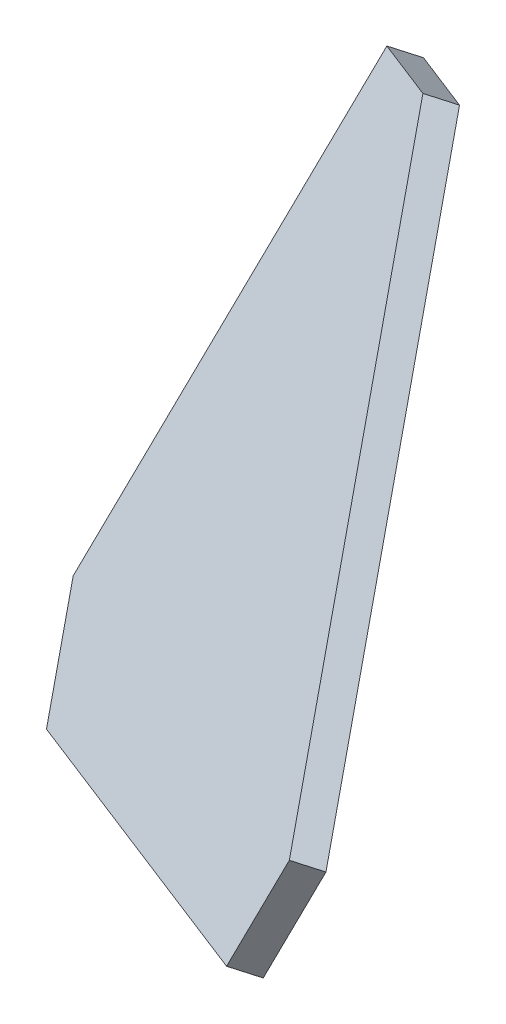
ISO-10303-21;
HEADER;
FILE_DESCRIPTION(('STEP AP214'),'2;1');
FILE_NAME('part.step','',(''),(''),'','','');
FILE_SCHEMA(('AUTOMOTIVE_DESIGN { 1 0 10303 214 1 1 1 1 }'));
ENDSEC;
DATA;
#1=APPLICATION_CONTEXT('core data for automotive mechanical design processes');
#2=APPLICATION_PROTOCOL_DEFINITION('international standard','automotive_design',2000,#1);
#3=PRODUCT_CONTEXT('',#1,'mechanical');
#4=PRODUCT('Part','Part','',(#3));
#5=PRODUCT_RELATED_PRODUCT_CATEGORY('part','',(#4));
#6=PRODUCT_DEFINITION_FORMATION('','',#4);
#7=PRODUCT_DEFINITION_CONTEXT('part definition',#1,'design');
#8=PRODUCT_DEFINITION('design','',#6,#7);
#9=PRODUCT_DEFINITION_SHAPE('','',#8);
#10=(LENGTH_UNIT() NAMED_UNIT(*) SI_UNIT(.MILLI.,.METRE.));
#11=(NAMED_UNIT(*) PLANE_ANGLE_UNIT() SI_UNIT($,.RADIAN.));
#12=(NAMED_UNIT(*) SI_UNIT($,.STERADIAN.) SOLID_ANGLE_UNIT());
#13=UNCERTAINTY_MEASURE_WITH_UNIT(LENGTH_MEASURE(1.E-05),#10,'distance_accuracy_value','');
#14=(GEOMETRIC_REPRESENTATION_CONTEXT(3) GLOBAL_UNCERTAINTY_ASSIGNED_CONTEXT((#13)) GLOBAL_UNIT_ASSIGNED_CONTEXT((#10,
#11,#12)) REPRESENTATION_CONTEXT('',''));
#15=CARTESIAN_POINT('',(0.,0.,0.));
#16=DIRECTION('',(0.,0.,1.));
#17=DIRECTION('',(1.,0.,0.));
#18=AXIS2_PLACEMENT_3D('',#15,#16,#17);
#19=CARTESIAN_POINT('',(1882.18704810196,3462.94317456264,123.456412175588));
#20=DIRECTION('',(-0.682550596637253,0.347776899554287,0.642787609686541));
#21=DIRECTION('',(0.685583574830509,0.,0.727993929866602));
#22=AXIS2_PLACEMENT_3D('',#19,#20,#21);
#23=PLANE('',#22);
#24=DIRECTION('',(0.453990499739547,0.891006524188367,0.));
#25=VECTOR('',#24,1.);
#26=CARTESIAN_POINT('',(1847.82337086807,3480.45234265152,77.4937455884498));
#27=LINE('',#26,#25);
#28=CARTESIAN_POINT('',(1847.82337086807,3480.45234265152,77.4937455884498));
#29=VERTEX_POINT('',#28);
#30=CARTESIAN_POINT('',(1870.52289585505,3525.00266886094,77.4937455884498));
#31=VERTEX_POINT('',#30);
#32=EDGE_CURVE('E113',#29,#31,#27,.T.);
#33=ORIENTED_EDGE('',*,*,#32,.T.);
#34=DIRECTION('',(-0.725999580936584,-0.423689230525368,-0.541675220419696));
#35=VECTOR('',#34,1.);
#36=CARTESIAN_POINT('',(1870.52289585505,3525.00266886094,77.4937455884498));
#37=LINE('',#36,#35);
#38=CARTESIAN_POINT('',(1880.79008039142,3530.99453942134,85.1541900196396));
#39=VERTEX_POINT('',#38);
#40=EDGE_CURVE('E63',#31,#39,#37,.F.);
#41=ORIENTED_EDGE('',*,*,#40,.T.);
#42=DIRECTION('',(0.572727953898155,-0.29181946814798,0.766044443118976));
#43=VECTOR('',#42,1.);
#44=CARTESIAN_POINT('',(1909.42647808633,3516.40356601394,123.456412175588));
#45=LINE('',#44,#43);
#46=CARTESIAN_POINT('',(1909.42647808633,3516.40356601394,123.456412175588));
#47=VERTEX_POINT('',#46);
#48=EDGE_CURVE('E121',#39,#47,#45,.T.);
#49=ORIENTED_EDGE('',*,*,#48,.T.);
#50=DIRECTION('',(0.453990499739547,0.891006524188367,0.));
#51=VECTOR('',#50,1.);
#52=CARTESIAN_POINT('',(1882.18704810196,3462.94317456264,123.456412175588));
#53=LINE('',#52,#51);
#54=CARTESIAN_POINT('',(1904.88657308893,3507.49350077206,123.456412175588));
#55=VERTEX_POINT('',#54);
#56=EDGE_CURVE('E129',#55,#47,#53,.T.);
#57=ORIENTED_EDGE('',*,*,#56,.F.);
#58=DIRECTION('',(-0.725999580936585,-0.423689230525358,-0.541675220419702));
#59=VECTOR('',#58,1.);
#60=CARTESIAN_POINT('',(1853.55065040705,3477.53414797004,85.15419001964));
#61=LINE('',#60,#59);
#62=CARTESIAN_POINT('',(1853.55065040705,3477.53414797004,85.1541900196393));
#63=VERTEX_POINT('',#62);
#64=EDGE_CURVE('E137',#55,#63,#61,.T.);
#65=ORIENTED_EDGE('',*,*,#64,.T.);
#66=DIRECTION('',(0.572727953898155,-0.29181946814798,0.766044443118976));
#67=VECTOR('',#66,1.);
#68=CARTESIAN_POINT('',(1882.18704810196,3462.94317456264,123.456412175588));
#69=LINE('',#68,#67);
#70=EDGE_CURVE('E103',#29,#63,#69,.T.);
#71=ORIENTED_EDGE('',*,*,#70,.F.);
#72=EDGE_LOOP('',(#33,#41,#49,#57,#65,#71));
#73=FACE_BOUND('',#72,.T.);
#74=ADVANCED_FACE('F41',(#73),#23,.F.);
#75=CARTESIAN_POINT('',(1882.18704810196,3462.94317456264,123.456412175588));
#76=DIRECTION('',(-0.572727953898148,0.291819468147979,-0.766044443118982));
#77=DIRECTION('',(-0.800905105421492,0.,0.598791292613536));
#78=AXIS2_PLACEMENT_3D('',#75,#76,#77);
#79=PLANE('',#78);
#80=DIRECTION('',(0.453990499739547,0.891006524188367,0.));
#81=VECTOR('',#80,1.);
#82=CARTESIAN_POINT('',(1880.82194690868,3463.63872836175,124.741987394962));
#83=LINE('',#82,#81);
#84=CARTESIAN_POINT('',(1903.52147189566,3508.18905457117,124.741987394962));
#85=VERTEX_POINT('',#84);
#86=CARTESIAN_POINT('',(1908.06137689306,3517.09911981305,124.741987394962));
#87=VERTEX_POINT('',#86);
#88=EDGE_CURVE('E112',#85,#87,#83,.T.);
#89=ORIENTED_EDGE('',*,*,#88,.F.);
#90=DIRECTION('',(0.682550596637234,-0.347776899554337,-0.642787609686534));
#91=VECTOR('',#90,1.);
#92=CARTESIAN_POINT('',(1904.88657308894,3507.49350077206,123.456412175587));
#93=LINE('',#92,#91);
#94=EDGE_CURVE('E135',#85,#55,#93,.T.);
#95=ORIENTED_EDGE('',*,*,#94,.T.);
#96=ORIENTED_EDGE('',*,*,#56,.T.);
#97=DIRECTION('',(-0.682550596637234,0.347776899554337,0.642787609686534));
#98=VECTOR('',#97,1.);
#99=CARTESIAN_POINT('',(1909.42647808633,3516.40356601394,123.456412175588));
#100=LINE('',#99,#98);
#101=EDGE_CURVE('E123',#47,#87,#100,.T.);
#102=ORIENTED_EDGE('',*,*,#101,.T.);
#103=EDGE_LOOP('',(#89,#95,#96,#102));
#104=FACE_BOUND('',#103,.T.);
#105=ADVANCED_FACE('F149',(#104),#79,.F.);
#106=CARTESIAN_POINT('',(1880.82194690868,3463.63872836175,124.741987394962));
#107=DIRECTION('',(0.682550596637253,-0.347776899554287,-0.642787609686541));
#108=DIRECTION('',(-0.685583574830509,0.,-0.727993929866602));
#109=AXIS2_PLACEMENT_3D('',#106,#107,#108);
#110=PLANE('',#109);
#111=DIRECTION('',(-0.572727953898155,0.29181946814798,-0.766044443118977));
#112=VECTOR('',#111,1.);
#113=CARTESIAN_POINT('',(1908.06137689306,3517.09911981305,124.741987394962));
#114=LINE('',#113,#112);
#115=CARTESIAN_POINT('',(1879.42497919815,3531.69009322045,86.4397652390121));
#116=VERTEX_POINT('',#115);
#117=EDGE_CURVE('E126',#87,#116,#114,.T.);
#118=ORIENTED_EDGE('',*,*,#117,.T.);
#119=DIRECTION('',(0.725999580936584,0.423689230525368,0.541675220419696));
#120=VECTOR('',#119,1.);
#121=CARTESIAN_POINT('',(1869.15779466177,3525.69822266005,78.7793208078229));
#122=LINE('',#121,#120);
#123=CARTESIAN_POINT('',(1869.15779466177,3525.69822266005,78.7793208078229));
#124=VERTEX_POINT('',#123);
#125=EDGE_CURVE('E11',#116,#124,#122,.F.);
#126=ORIENTED_EDGE('',*,*,#125,.T.);
#127=DIRECTION('',(0.453990499739547,0.891006524188367,0.));
#128=VECTOR('',#127,1.);
#129=CARTESIAN_POINT('',(1846.45826967479,3481.14789645063,78.7793208078229));
#130=LINE('',#129,#128);
#131=CARTESIAN_POINT('',(1846.45826967479,3481.14789645063,78.7793208078229));
#132=VERTEX_POINT('',#131);
#133=EDGE_CURVE('E106',#132,#124,#130,.T.);
#134=ORIENTED_EDGE('',*,*,#133,.F.);
#135=DIRECTION('',(-0.572727953898155,0.29181946814798,-0.766044443118977));
#136=VECTOR('',#135,1.);
#137=CARTESIAN_POINT('',(1880.82194690868,3463.63872836175,124.741987394962));
#138=LINE('',#137,#136);
#139=CARTESIAN_POINT('',(1852.18554921377,3478.22970176915,86.4397652390124));
#140=VERTEX_POINT('',#139);
#141=EDGE_CURVE('E93',#140,#132,#138,.T.);
#142=ORIENTED_EDGE('',*,*,#141,.F.);
#143=DIRECTION('',(0.725999580936585,0.423689230525358,0.541675220419703));
#144=VECTOR('',#143,1.);
#145=CARTESIAN_POINT('',(1852.18554921378,3478.22970176915,86.439765239013));
#146=LINE('',#145,#144);
#147=EDGE_CURVE('E133',#140,#85,#146,.T.);
#148=ORIENTED_EDGE('',*,*,#147,.T.);
#149=ORIENTED_EDGE('',*,*,#88,.T.);
#150=EDGE_LOOP('',(#118,#126,#134,#142,#148,#149));
#151=FACE_BOUND('',#150,.T.);
#152=ADVANCED_FACE('F107',(#151),#110,.F.);
#153=CARTESIAN_POINT('',(1846.45826967479,3481.14789645063,78.7793208078229));
#154=DIRECTION('',(0.572727953898141,-0.291819468147975,0.766044443118989));
#155=DIRECTION('',(0.800905105421498,0.,-0.598791292613527));
#156=AXIS2_PLACEMENT_3D('',#153,#154,#155);
#157=PLANE('',#156);
#158=ORIENTED_EDGE('',*,*,#133,.T.);
#159=DIRECTION('',(0.68255059663724,-0.34777689955434,-0.642787609686526));
#160=VECTOR('',#159,1.);
#161=CARTESIAN_POINT('',(1869.15779466177,3525.69822266005,78.7793208078212));
#162=LINE('',#161,#160);
#163=EDGE_CURVE('E139',#124,#31,#162,.T.);
#164=ORIENTED_EDGE('',*,*,#163,.T.);
#165=ORIENTED_EDGE('',*,*,#32,.F.);
#166=DIRECTION('',(0.68255059663724,-0.34777689955434,-0.642787609686526));
#167=VECTOR('',#166,1.);
#168=CARTESIAN_POINT('',(1846.45826967479,3481.14789645063,78.7793208078229));
#169=LINE('',#168,#167);
#170=EDGE_CURVE('E98',#132,#29,#169,.T.);
#171=ORIENTED_EDGE('',*,*,#170,.F.);
#172=EDGE_LOOP('',(#158,#164,#165,#171));
#173=FACE_BOUND('',#172,.T.);
#174=ADVANCED_FACE('F115',(#173),#157,.F.);
#175=CARTESIAN_POINT('',(1788.72256897396,3510.5657053021,-1.42219087416938E-10));
#176=DIRECTION('',(-0.453990499739582,-0.89100652418835,0.));
#177=DIRECTION('',(0.89100652418835,-0.453990499739582,0.));
#178=AXIS2_PLACEMENT_3D('',#175,#176,#177);
#179=PLANE('',#178);
#180=ORIENTED_EDGE('',*,*,#70,.T.);
#181=DIRECTION('',(-0.682550596637234,0.347776899554337,0.642787609686534));
#182=VECTOR('',#181,1.);
#183=CARTESIAN_POINT('',(1852.18554921378,3478.22970176915,86.4397652390128));
#184=LINE('',#183,#182);
#185=EDGE_CURVE('E101',#63,#140,#184,.T.);
#186=ORIENTED_EDGE('',*,*,#185,.T.);
#187=ORIENTED_EDGE('',*,*,#141,.T.);
#188=ORIENTED_EDGE('',*,*,#170,.T.);
#189=EDGE_LOOP('',(#180,#186,#187,#188));
#190=FACE_BOUND('',#189,.T.);
#191=ADVANCED_FACE('F96',(#190),#179,.T.);
#192=CARTESIAN_POINT('',(1815.96199895833,3564.0260967534,-1.42219569454483E-10));
#193=DIRECTION('',(-0.453990499739582,-0.89100652418835,0.));
#194=DIRECTION('',(0.89100652418835,-0.453990499739582,0.));
#195=AXIS2_PLACEMENT_3D('',#192,#193,#194);
#196=PLANE('',#195);
#197=ORIENTED_EDGE('',*,*,#48,.F.);
#198=DIRECTION('',(-0.68255059663724,0.34777689955434,0.642787609686526));
#199=VECTOR('',#198,1.);
#200=CARTESIAN_POINT('',(1880.10752979493,3531.34231632083,85.7969776291921));
#201=LINE('',#200,#199);
#202=EDGE_CURVE('E49',#39,#116,#201,.T.);
#203=ORIENTED_EDGE('',*,*,#202,.T.);
#204=ORIENTED_EDGE('',*,*,#117,.F.);
#205=ORIENTED_EDGE('',*,*,#101,.F.);
#206=EDGE_LOOP('',(#197,#203,#204,#205));
#207=FACE_BOUND('',#206,.T.);
#208=ADVANCED_FACE('F151',(#207),#196,.F.);
#209=CARTESIAN_POINT('',(1852.86809981056,3477.88192486952,85.7969776291918));
#210=DIRECTION('',(0.0839600590163456,-0.836384280144726,0.541675220419727));
#211=DIRECTION('',(0.682550596637234,-0.347776899554337,-0.642787609686534));
#212=AXIS2_PLACEMENT_3D('',#209,#210,#211);
#213=PLANE('',#212);
#214=ORIENTED_EDGE('',*,*,#64,.F.);
#215=ORIENTED_EDGE('',*,*,#94,.F.);
#216=ORIENTED_EDGE('',*,*,#147,.F.);
#217=ORIENTED_EDGE('',*,*,#185,.F.);
#218=EDGE_LOOP('',(#214,#215,#216,#217));
#219=FACE_BOUND('',#218,.T.);
#220=ADVANCED_FACE('F145',(#219),#213,.T.);
#221=CARTESIAN_POINT('',(1869.15779466177,3525.69822266005,78.7793208078212));
#222=DIRECTION('',(0.0839600590163496,-0.836384280144718,0.541675220419739));
#223=DIRECTION('',(0.68255059663724,-0.34777689955434,-0.642787609686526));
#224=AXIS2_PLACEMENT_3D('',#221,#222,#223);
#225=PLANE('',#224);
#226=ORIENTED_EDGE('',*,*,#125,.F.);
#227=ORIENTED_EDGE('',*,*,#202,.F.);
#228=ORIENTED_EDGE('',*,*,#40,.F.);
#229=ORIENTED_EDGE('',*,*,#163,.F.);
#230=EDGE_LOOP('',(#226,#227,#228,#229));
#231=FACE_BOUND('',#230,.T.);
#232=ADVANCED_FACE('F43',(#231),#225,.F.);
#233=CLOSED_SHELL('',(#74,#105,#152,#174,#191,#208,#220,#232));
#234=MANIFOLD_SOLID_BREP('B2',#233);
#235=ADVANCED_BREP_SHAPE_REPRESENTATION('',(#18,#234),#14);
#236=SHAPE_DEFINITION_REPRESENTATION(#9,#235);
ENDSEC;
END-ISO-10303-21;
